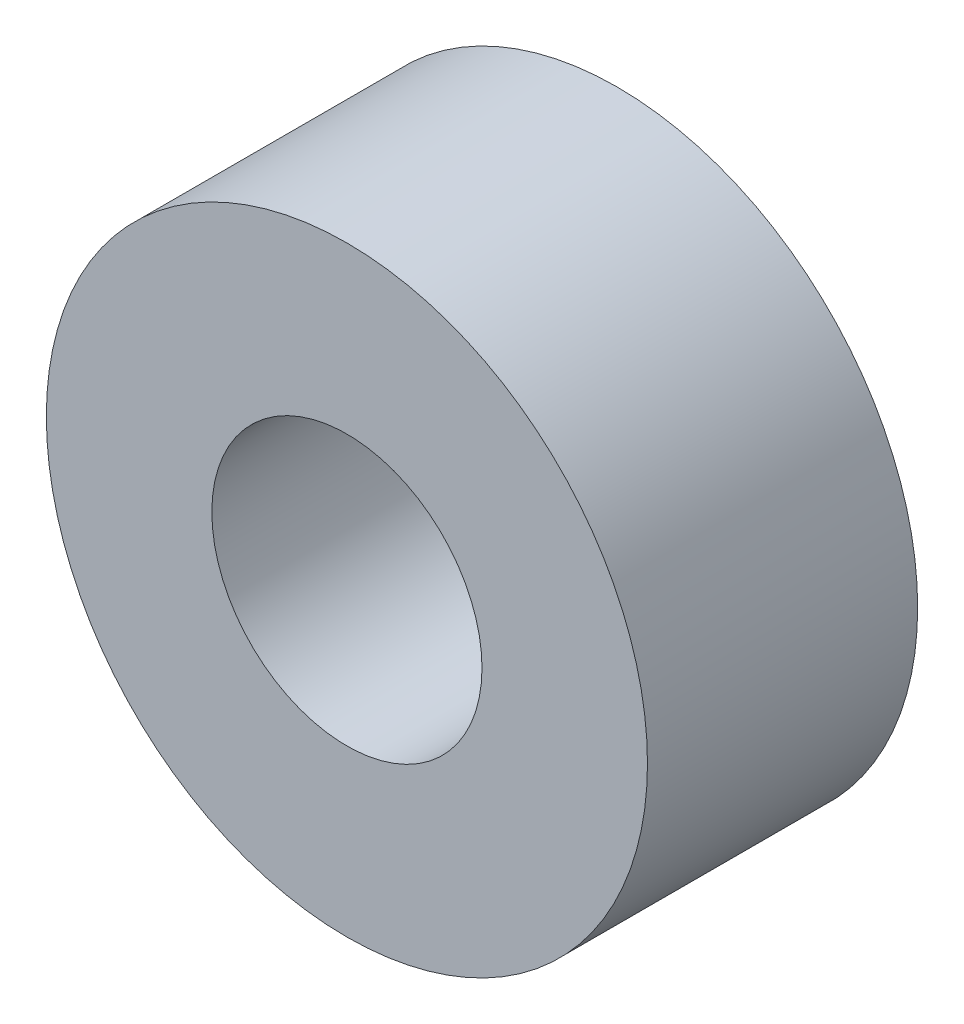
ISO-10303-21;
HEADER;
FILE_DESCRIPTION(('STEP AP214'),'2;1');
FILE_NAME('part.step','',(''),(''),'','','');
FILE_SCHEMA(('AUTOMOTIVE_DESIGN { 1 0 10303 214 1 1 1 1 }'));
ENDSEC;
DATA;
#1=APPLICATION_CONTEXT('core data for automotive mechanical design processes');
#2=APPLICATION_PROTOCOL_DEFINITION('international standard','automotive_design',2000,#1);
#3=PRODUCT_CONTEXT('',#1,'mechanical');
#4=PRODUCT('Part','Part','',(#3));
#5=PRODUCT_RELATED_PRODUCT_CATEGORY('part','',(#4));
#6=PRODUCT_DEFINITION_FORMATION('','',#4);
#7=PRODUCT_DEFINITION_CONTEXT('part definition',#1,'design');
#8=PRODUCT_DEFINITION('design','',#6,#7);
#9=PRODUCT_DEFINITION_SHAPE('','',#8);
#10=(LENGTH_UNIT() NAMED_UNIT(*) SI_UNIT(.MILLI.,.METRE.));
#11=(NAMED_UNIT(*) PLANE_ANGLE_UNIT() SI_UNIT($,.RADIAN.));
#12=(NAMED_UNIT(*) SI_UNIT($,.STERADIAN.) SOLID_ANGLE_UNIT());
#13=UNCERTAINTY_MEASURE_WITH_UNIT(LENGTH_MEASURE(1.E-05),#10,'distance_accuracy_value','');
#14=(GEOMETRIC_REPRESENTATION_CONTEXT(3) GLOBAL_UNCERTAINTY_ASSIGNED_CONTEXT((#13)) GLOBAL_UNIT_ASSIGNED_CONTEXT((#10,
#11,#12)) REPRESENTATION_CONTEXT('',''));
#15=CARTESIAN_POINT('',(0.,0.,0.));
#16=DIRECTION('',(0.,0.,1.));
#17=DIRECTION('',(1.,0.,0.));
#18=AXIS2_PLACEMENT_3D('',#15,#16,#17);
#19=CARTESIAN_POINT('',(0.,0.,8.));
#20=DIRECTION('',(0.,0.,1.));
#21=DIRECTION('',(1.,0.,0.));
#22=AXIS2_PLACEMENT_3D('',#19,#20,#21);
#23=PLANE('',#22);
#24=CARTESIAN_POINT('',(0.,0.,8.));
#25=DIRECTION('',(0.,0.,1.));
#26=DIRECTION('',(1.,0.,0.));
#27=AXIS2_PLACEMENT_3D('',#24,#25,#26);
#28=CIRCLE('',#27,8.9);
#29=CARTESIAN_POINT('',(8.9,0.,8.));
#30=VERTEX_POINT('',#29);
#31=EDGE_CURVE('E10',#30,#30,#28,.T.);
#32=ORIENTED_EDGE('',*,*,#31,.T.);
#33=EDGE_LOOP('',(#32));
#34=FACE_BOUND('',#33,.T.);
#35=CARTESIAN_POINT('',(0.,0.,8.));
#36=DIRECTION('',(0.,0.,1.));
#37=DIRECTION('',(1.,0.,0.));
#38=AXIS2_PLACEMENT_3D('',#35,#36,#37);
#39=CIRCLE('',#38,4.);
#40=CARTESIAN_POINT('',(4.,0.,8.));
#41=VERTEX_POINT('',#40);
#42=EDGE_CURVE('E42',#41,#41,#39,.T.);
#43=ORIENTED_EDGE('',*,*,#42,.F.);
#44=EDGE_LOOP('',(#43));
#45=FACE_BOUND('',#44,.T.);
#46=ADVANCED_FACE('F31',(#34,#45),#23,.T.);
#47=CARTESIAN_POINT('',(0.,0.,0.));
#48=DIRECTION('',(0.,0.,1.));
#49=DIRECTION('',(1.,0.,0.));
#50=AXIS2_PLACEMENT_3D('',#47,#48,#49);
#51=PLANE('',#50);
#52=CARTESIAN_POINT('',(0.,0.,0.));
#53=DIRECTION('',(0.,0.,1.));
#54=DIRECTION('',(1.,0.,0.));
#55=AXIS2_PLACEMENT_3D('',#52,#53,#54);
#56=CIRCLE('',#55,8.9);
#57=CARTESIAN_POINT('',(8.9,0.,0.));
#58=VERTEX_POINT('',#57);
#59=EDGE_CURVE('E35',#58,#58,#56,.T.);
#60=ORIENTED_EDGE('',*,*,#59,.F.);
#61=EDGE_LOOP('',(#60));
#62=FACE_BOUND('',#61,.T.);
#63=CARTESIAN_POINT('',(0.,0.,0.));
#64=DIRECTION('',(0.,0.,1.));
#65=DIRECTION('',(1.,0.,0.));
#66=AXIS2_PLACEMENT_3D('',#63,#64,#65);
#67=CIRCLE('',#66,4.);
#68=CARTESIAN_POINT('',(4.,0.,0.));
#69=VERTEX_POINT('',#68);
#70=EDGE_CURVE('E44',#69,#69,#67,.T.);
#71=ORIENTED_EDGE('',*,*,#70,.T.);
#72=EDGE_LOOP('',(#71));
#73=FACE_BOUND('',#72,.T.);
#74=ADVANCED_FACE('F54',(#62,#73),#51,.F.);
#75=CARTESIAN_POINT('',(0.,0.,8.));
#76=DIRECTION('',(0.,0.,-1.));
#77=DIRECTION('',(-1.,0.,0.));
#78=AXIS2_PLACEMENT_3D('',#75,#76,#77);
#79=CYLINDRICAL_SURFACE('',#78,8.9);
#80=ORIENTED_EDGE('',*,*,#31,.F.);
#81=EDGE_LOOP('',(#80));
#82=FACE_BOUND('',#81,.T.);
#83=ORIENTED_EDGE('',*,*,#59,.T.);
#84=EDGE_LOOP('',(#83));
#85=FACE_BOUND('',#84,.T.);
#86=ADVANCED_FACE('F33',(#82,#85),#79,.T.);
#87=CARTESIAN_POINT('',(0.,0.,8.));
#88=DIRECTION('',(0.,0.,-1.));
#89=DIRECTION('',(-1.,0.,0.));
#90=AXIS2_PLACEMENT_3D('',#87,#88,#89);
#91=CYLINDRICAL_SURFACE('',#90,4.);
#92=ORIENTED_EDGE('',*,*,#42,.T.);
#93=EDGE_LOOP('',(#92));
#94=FACE_BOUND('',#93,.T.);
#95=ORIENTED_EDGE('',*,*,#70,.F.);
#96=EDGE_LOOP('',(#95));
#97=FACE_BOUND('',#96,.T.);
#98=ADVANCED_FACE('F50',(#94,#97),#91,.F.);
#99=CLOSED_SHELL('',(#46,#74,#86,#98));
#100=MANIFOLD_SOLID_BREP('B2',#99);
#101=ADVANCED_BREP_SHAPE_REPRESENTATION('',(#18,#100),#14);
#102=SHAPE_DEFINITION_REPRESENTATION(#9,#101);
ENDSEC;
END-ISO-10303-21;
